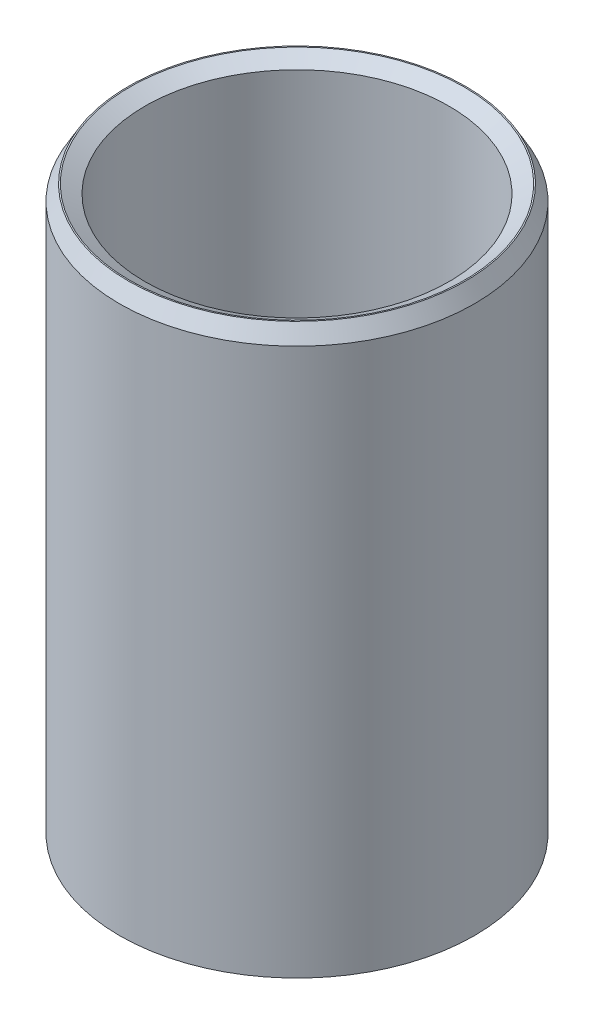
ISO-10303-21;
HEADER;
FILE_DESCRIPTION(('STEP AP214'),'2;1');
FILE_NAME('part.step','',(''),(''),'','','');
FILE_SCHEMA(('AUTOMOTIVE_DESIGN { 1 0 10303 214 1 1 1 1 }'));
ENDSEC;
DATA;
#1=APPLICATION_CONTEXT('core data for automotive mechanical design processes');
#2=APPLICATION_PROTOCOL_DEFINITION('international standard','automotive_design',2000,#1);
#3=PRODUCT_CONTEXT('',#1,'mechanical');
#4=PRODUCT('Part','Part','',(#3));
#5=PRODUCT_RELATED_PRODUCT_CATEGORY('part','',(#4));
#6=PRODUCT_DEFINITION_FORMATION('','',#4);
#7=PRODUCT_DEFINITION_CONTEXT('part definition',#1,'design');
#8=PRODUCT_DEFINITION('design','',#6,#7);
#9=PRODUCT_DEFINITION_SHAPE('','',#8);
#10=(LENGTH_UNIT() NAMED_UNIT(*) SI_UNIT(.MILLI.,.METRE.));
#11=(NAMED_UNIT(*) PLANE_ANGLE_UNIT() SI_UNIT($,.RADIAN.));
#12=(NAMED_UNIT(*) SI_UNIT($,.STERADIAN.) SOLID_ANGLE_UNIT());
#13=UNCERTAINTY_MEASURE_WITH_UNIT(LENGTH_MEASURE(1.E-05),#10,'distance_accuracy_value','');
#14=(GEOMETRIC_REPRESENTATION_CONTEXT(3) GLOBAL_UNCERTAINTY_ASSIGNED_CONTEXT((#13)) GLOBAL_UNIT_ASSIGNED_CONTEXT((#10,
#11,#12)) REPRESENTATION_CONTEXT('',''));
#15=CARTESIAN_POINT('',(0.,0.,0.));
#16=DIRECTION('',(0.,0.,1.));
#17=DIRECTION('',(1.,0.,0.));
#18=AXIS2_PLACEMENT_3D('',#15,#16,#17);
#19=CARTESIAN_POINT('',(0.,88.5256769490536,0.));
#20=DIRECTION('',(0.,-1.,0.));
#21=DIRECTION('',(0.,0.,-1.));
#22=AXIS2_PLACEMENT_3D('',#19,#20,#21);
#23=CYLINDRICAL_SURFACE('',#22,27.5);
#24=CARTESIAN_POINT('',(0.,1.36824394061234,0.));
#25=DIRECTION('',(0.,1.,0.));
#26=DIRECTION('',(0.,0.,1.));
#27=AXIS2_PLACEMENT_3D('',#24,#25,#26);
#28=CIRCLE('',#27,27.5);
#29=CARTESIAN_POINT('',(0.,1.36824394061234,27.5));
#30=VERTEX_POINT('',#29);
#31=EDGE_CURVE('E10',#30,#30,#28,.T.);
#32=ORIENTED_EDGE('',*,*,#31,.T.);
#33=EDGE_LOOP('',(#32));
#34=FACE_BOUND('',#33,.T.);
#35=CARTESIAN_POINT('',(0.,86.1558089267647,0.));
#36=DIRECTION('',(0.,1.,0.));
#37=DIRECTION('',(0.,0.,1.));
#38=AXIS2_PLACEMENT_3D('',#35,#36,#37);
#39=CIRCLE('',#38,27.5);
#40=CARTESIAN_POINT('',(0.,86.1558089267647,27.5));
#41=VERTEX_POINT('',#40);
#42=EDGE_CURVE('E50',#41,#41,#39,.F.);
#43=ORIENTED_EDGE('',*,*,#42,.T.);
#44=EDGE_LOOP('',(#43));
#45=FACE_BOUND('',#44,.T.);
#46=ADVANCED_FACE('F39',(#34,#45),#23,.T.);
#47=CARTESIAN_POINT('',(0.,88.5256769490536,0.));
#48=DIRECTION('',(0.,1.,0.));
#49=DIRECTION('',(0.,0.,1.));
#50=AXIS2_PLACEMENT_3D('',#47,#48,#49);
#51=PLANE('',#50);
#52=CARTESIAN_POINT('',(0.,88.5256769490536,0.));
#53=DIRECTION('',(0.,1.,0.));
#54=DIRECTION('',(0.,0.,1.));
#55=AXIS2_PLACEMENT_3D('',#52,#53,#54);
#56=CIRCLE('',#55,25.9293308043863);
#57=CARTESIAN_POINT('',(0.,88.5256769490536,25.9293308043863));
#58=VERTEX_POINT('',#57);
#59=EDGE_CURVE('E58',#58,#58,#56,.F.);
#60=ORIENTED_EDGE('',*,*,#59,.T.);
#61=EDGE_LOOP('',(#60));
#62=FACE_BOUND('',#61,.T.);
#63=CARTESIAN_POINT('',(0.,88.5256769490536,0.));
#64=DIRECTION('',(0.,1.,0.));
#65=DIRECTION('',(0.,0.,1.));
#66=AXIS2_PLACEMENT_3D('',#63,#64,#65);
#67=CIRCLE('',#66,26.1317560593876);
#68=CARTESIAN_POINT('',(0.,88.5256769490536,26.1317560593876));
#69=VERTEX_POINT('',#68);
#70=EDGE_CURVE('E61',#69,#69,#67,.T.);
#71=ORIENTED_EDGE('',*,*,#70,.T.);
#72=EDGE_LOOP('',(#71));
#73=FACE_BOUND('',#72,.T.);
#74=ADVANCED_FACE('F88',(#62,#73),#51,.T.);
#75=CARTESIAN_POINT('',(0.,0.,0.));
#76=DIRECTION('',(0.,1.,0.));
#77=DIRECTION('',(0.,0.,1.));
#78=AXIS2_PLACEMENT_3D('',#75,#76,#77);
#79=PLANE('',#78);
#80=CARTESIAN_POINT('',(0.,0.,0.));
#81=DIRECTION('',(0.,1.,0.));
#82=DIRECTION('',(0.,0.,1.));
#83=AXIS2_PLACEMENT_3D('',#80,#81,#82);
#84=CIRCLE('',#83,24.9277067227098);
#85=CARTESIAN_POINT('',(0.,0.,24.9277067227098));
#86=VERTEX_POINT('',#85);
#87=EDGE_CURVE('E51',#86,#86,#84,.T.);
#88=ORIENTED_EDGE('',*,*,#87,.T.);
#89=EDGE_LOOP('',(#88));
#90=FACE_BOUND('',#89,.T.);
#91=CARTESIAN_POINT('',(0.,0.,0.));
#92=DIRECTION('',(0.,1.,0.));
#93=DIRECTION('',(0.,0.,1.));
#94=AXIS2_PLACEMENT_3D('',#91,#92,#93);
#95=CIRCLE('',#94,25.1301319777111);
#96=CARTESIAN_POINT('',(0.,0.,25.1301319777111));
#97=VERTEX_POINT('',#96);
#98=EDGE_CURVE('E54',#97,#97,#95,.F.);
#99=ORIENTED_EDGE('',*,*,#98,.T.);
#100=EDGE_LOOP('',(#99));
#101=FACE_BOUND('',#100,.T.);
#102=ADVANCED_FACE('F83',(#90,#101),#79,.F.);
#103=CARTESIAN_POINT('',(0.,88.5256769490536,0.));
#104=DIRECTION('',(0.,-1.,0.));
#105=DIRECTION('',(0.,0.,-1.));
#106=AXIS2_PLACEMENT_3D('',#103,#104,#105);
#107=CYLINDRICAL_SURFACE('',#106,23.5594627820975);
#108=CARTESIAN_POINT('',(0.,87.1574330084412,0.));
#109=DIRECTION('',(0.,1.,0.));
#110=DIRECTION('',(0.,0.,1.));
#111=AXIS2_PLACEMENT_3D('',#108,#109,#110);
#112=CIRCLE('',#111,23.5594627820975);
#113=CARTESIAN_POINT('',(0.,87.1574330084412,23.5594627820975));
#114=VERTEX_POINT('',#113);
#115=EDGE_CURVE('E67',#114,#114,#112,.T.);
#116=ORIENTED_EDGE('',*,*,#115,.T.);
#117=EDGE_LOOP('',(#116));
#118=FACE_BOUND('',#117,.T.);
#119=CARTESIAN_POINT('',(0.,2.36986802228885,0.));
#120=DIRECTION('',(0.,1.,0.));
#121=DIRECTION('',(0.,0.,1.));
#122=AXIS2_PLACEMENT_3D('',#119,#120,#121);
#123=CIRCLE('',#122,23.5594627820975);
#124=CARTESIAN_POINT('',(0.,2.36986802228885,23.5594627820975));
#125=VERTEX_POINT('',#124);
#126=EDGE_CURVE('E69',#125,#125,#123,.F.);
#127=ORIENTED_EDGE('',*,*,#126,.T.);
#128=EDGE_LOOP('',(#127));
#129=FACE_BOUND('',#128,.T.);
#130=ADVANCED_FACE('F71',(#118,#129),#107,.F.);
#131=CARTESIAN_POINT('',(0.,87.1574330084412,0.));
#132=DIRECTION('',(0.,1.,0.));
#133=DIRECTION('',(0.,0.,1.));
#134=AXIS2_PLACEMENT_3D('',#131,#132,#133);
#135=CONICAL_SURFACE('',#134,23.5594627820975,1.0471975511966);
#136=ORIENTED_EDGE('',*,*,#59,.F.);
#137=EDGE_LOOP('',(#136));
#138=FACE_BOUND('',#137,.T.);
#139=ORIENTED_EDGE('',*,*,#115,.F.);
#140=EDGE_LOOP('',(#139));
#141=FACE_BOUND('',#140,.T.);
#142=ADVANCED_FACE('F77',(#138,#141),#135,.F.);
#143=CARTESIAN_POINT('',(0.,0.,0.));
#144=DIRECTION('',(0.,-1.,0.));
#145=DIRECTION('',(0.,0.,-1.));
#146=AXIS2_PLACEMENT_3D('',#143,#144,#145);
#147=CONICAL_SURFACE('',#146,24.9277067227098,0.523598775598296);
#148=ORIENTED_EDGE('',*,*,#126,.F.);
#149=EDGE_LOOP('',(#148));
#150=FACE_BOUND('',#149,.T.);
#151=ORIENTED_EDGE('',*,*,#87,.F.);
#152=EDGE_LOOP('',(#151));
#153=FACE_BOUND('',#152,.T.);
#154=ADVANCED_FACE('F73',(#150,#153),#147,.F.);
#155=CARTESIAN_POINT('',(0.,1.36824394061234,0.));
#156=DIRECTION('',(0.,1.,0.));
#157=DIRECTION('',(0.,0.,1.));
#158=AXIS2_PLACEMENT_3D('',#155,#156,#157);
#159=CONICAL_SURFACE('',#158,27.5,1.0471975511966);
#160=ORIENTED_EDGE('',*,*,#98,.F.);
#161=EDGE_LOOP('',(#160));
#162=FACE_BOUND('',#161,.T.);
#163=ORIENTED_EDGE('',*,*,#31,.F.);
#164=EDGE_LOOP('',(#163));
#165=FACE_BOUND('',#164,.T.);
#166=ADVANCED_FACE('F76',(#162,#165),#159,.T.);
#167=CARTESIAN_POINT('',(0.,88.5256769490536,0.));
#168=DIRECTION('',(0.,-1.,0.));
#169=DIRECTION('',(0.,0.,-1.));
#170=AXIS2_PLACEMENT_3D('',#167,#168,#169);
#171=CONICAL_SURFACE('',#170,26.1317560593876,0.523598775598297);
#172=ORIENTED_EDGE('',*,*,#42,.F.);
#173=EDGE_LOOP('',(#172));
#174=FACE_BOUND('',#173,.T.);
#175=ORIENTED_EDGE('',*,*,#70,.F.);
#176=EDGE_LOOP('',(#175));
#177=FACE_BOUND('',#176,.T.);
#178=ADVANCED_FACE('F45',(#174,#177),#171,.T.);
#179=CLOSED_SHELL('',(#46,#74,#102,#130,#142,#154,#166,#178));
#180=MANIFOLD_SOLID_BREP('B2',#179);
#181=ADVANCED_BREP_SHAPE_REPRESENTATION('',(#18,#180),#14);
#182=SHAPE_DEFINITION_REPRESENTATION(#9,#181);
ENDSEC;
END-ISO-10303-21;
